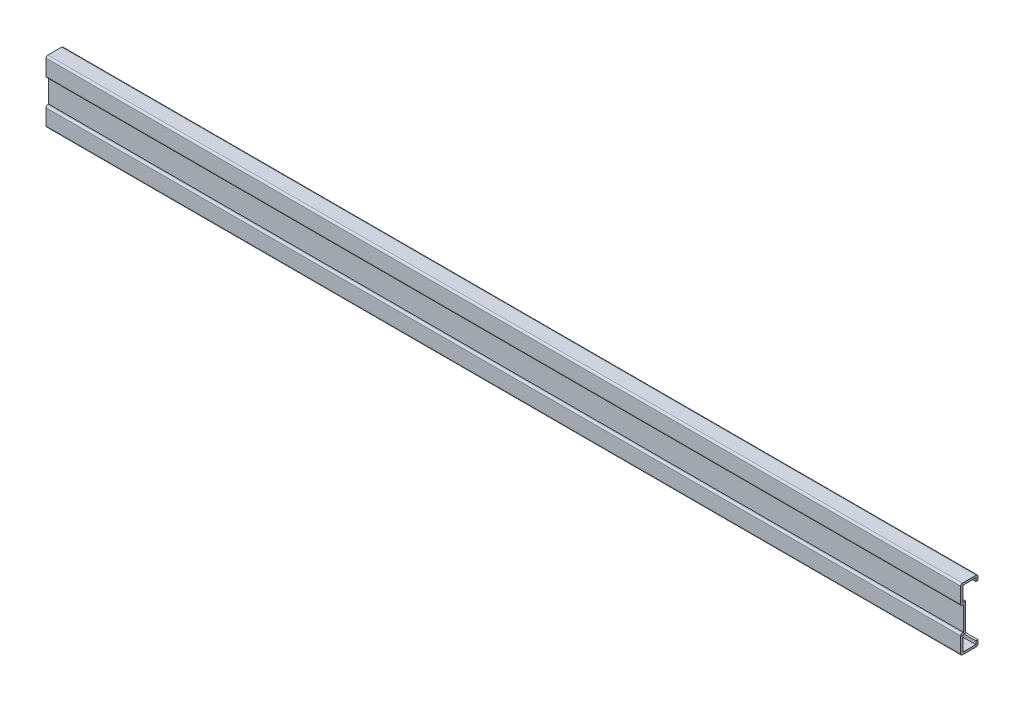
ISO-10303-21;
HEADER;
FILE_DESCRIPTION(('STEP AP214'),'2;1');
FILE_NAME('part.step','',(''),(''),'','','');
FILE_SCHEMA(('AUTOMOTIVE_DESIGN { 1 0 10303 214 1 1 1 1 }'));
ENDSEC;
DATA;
#1=APPLICATION_CONTEXT('core data for automotive mechanical design processes');
#2=APPLICATION_PROTOCOL_DEFINITION('international standard','automotive_design',2000,#1);
#3=PRODUCT_CONTEXT('',#1,'mechanical');
#4=PRODUCT('Part','Part','',(#3));
#5=PRODUCT_RELATED_PRODUCT_CATEGORY('part','',(#4));
#6=PRODUCT_DEFINITION_FORMATION('','',#4);
#7=PRODUCT_DEFINITION_CONTEXT('part definition',#1,'design');
#8=PRODUCT_DEFINITION('design','',#6,#7);
#9=PRODUCT_DEFINITION_SHAPE('','',#8);
#10=(LENGTH_UNIT() NAMED_UNIT(*) SI_UNIT(.MILLI.,.METRE.));
#11=(NAMED_UNIT(*) PLANE_ANGLE_UNIT() SI_UNIT($,.RADIAN.));
#12=(NAMED_UNIT(*) SI_UNIT($,.STERADIAN.) SOLID_ANGLE_UNIT());
#13=UNCERTAINTY_MEASURE_WITH_UNIT(LENGTH_MEASURE(1.E-05),#10,'distance_accuracy_value','');
#14=(GEOMETRIC_REPRESENTATION_CONTEXT(3) GLOBAL_UNCERTAINTY_ASSIGNED_CONTEXT((#13)) GLOBAL_UNIT_ASSIGNED_CONTEXT((#10,
#11,#12)) REPRESENTATION_CONTEXT('',''));
#15=CARTESIAN_POINT('',(0.,0.,0.));
#16=DIRECTION('',(0.,0.,1.));
#17=DIRECTION('',(1.,0.,0.));
#18=AXIS2_PLACEMENT_3D('',#15,#16,#17);
#19=CARTESIAN_POINT('',(500.,16.,-6.8));
#20=DIRECTION('',(0.,0.,-1.));
#21=DIRECTION('',(-1.,0.,0.));
#22=AXIS2_PLACEMENT_3D('',#19,#20,#21);
#23=PLANE('',#22);
#24=DIRECTION('',(0.,1.,0.));
#25=VECTOR('',#24,1.);
#26=CARTESIAN_POINT('',(0.,16.,-6.8));
#27=LINE('',#26,#25);
#28=CARTESIAN_POINT('',(0.,15.8,-6.8));
#29=VERTEX_POINT('',#28);
#30=CARTESIAN_POINT('',(0.,14.,-6.8));
#31=VERTEX_POINT('',#30);
#32=EDGE_CURVE('E237',#29,#31,#27,.F.);
#33=ORIENTED_EDGE('',*,*,#32,.T.);
#34=DIRECTION('',(-1.,0.,0.));
#35=VECTOR('',#34,1.);
#36=CARTESIAN_POINT('',(500.,14.,-6.8));
#37=LINE('',#36,#35);
#38=CARTESIAN_POINT('',(500.,14.,-6.8));
#39=VERTEX_POINT('',#38);
#40=EDGE_CURVE('E11',#39,#31,#37,.T.);
#41=ORIENTED_EDGE('',*,*,#40,.F.);
#42=DIRECTION('',(0.,1.,0.));
#43=VECTOR('',#42,1.);
#44=CARTESIAN_POINT('',(500.,16.,-6.8));
#45=LINE('',#44,#43);
#46=CARTESIAN_POINT('',(500.,15.8,-6.8));
#47=VERTEX_POINT('',#46);
#48=EDGE_CURVE('E144',#47,#39,#45,.F.);
#49=ORIENTED_EDGE('',*,*,#48,.F.);
#50=DIRECTION('',(-1.,0.,0.));
#51=VECTOR('',#50,1.);
#52=CARTESIAN_POINT('',(500.,15.8,-6.8));
#53=LINE('',#52,#51);
#54=EDGE_CURVE('E233',#47,#29,#53,.T.);
#55=ORIENTED_EDGE('',*,*,#54,.T.);
#56=EDGE_LOOP('',(#33,#41,#49,#55));
#57=FACE_BOUND('',#56,.T.);
#58=ADVANCED_FACE('F34',(#57),#23,.F.);
#59=CARTESIAN_POINT('',(500.,14.,-8.));
#60=DIRECTION('',(0.,-1.,0.));
#61=DIRECTION('',(0.,0.,-1.));
#62=AXIS2_PLACEMENT_3D('',#59,#60,#61);
#63=PLANE('',#62);
#64=DIRECTION('',(0.,0.,1.));
#65=VECTOR('',#64,1.);
#66=CARTESIAN_POINT('',(0.,14.,-8.));
#67=LINE('',#66,#65);
#68=CARTESIAN_POINT('',(0.,14.,-8.));
#69=VERTEX_POINT('',#68);
#70=EDGE_CURVE('E240',#69,#31,#67,.T.);
#71=ORIENTED_EDGE('',*,*,#70,.F.);
#72=DIRECTION('',(-1.,0.,0.));
#73=VECTOR('',#72,1.);
#74=CARTESIAN_POINT('',(500.,14.,-8.));
#75=LINE('',#74,#73);
#76=CARTESIAN_POINT('',(500.,14.,-8.));
#77=VERTEX_POINT('',#76);
#78=EDGE_CURVE('E42',#77,#69,#75,.T.);
#79=ORIENTED_EDGE('',*,*,#78,.F.);
#80=DIRECTION('',(0.,0.,1.));
#81=VECTOR('',#80,1.);
#82=CARTESIAN_POINT('',(500.,14.,-8.));
#83=LINE('',#82,#81);
#84=EDGE_CURVE('E372',#77,#39,#83,.T.);
#85=ORIENTED_EDGE('',*,*,#84,.T.);
#86=ORIENTED_EDGE('',*,*,#40,.T.);
#87=EDGE_LOOP('',(#71,#79,#85,#86));
#88=FACE_BOUND('',#87,.T.);
#89=ADVANCED_FACE('F359',(#88),#63,.T.);
#90=CARTESIAN_POINT('',(500.,16.,-8.));
#91=DIRECTION('',(0.,0.,-1.));
#92=DIRECTION('',(-1.,0.,0.));
#93=AXIS2_PLACEMENT_3D('',#90,#91,#92);
#94=PLANE('',#93);
#95=DIRECTION('',(0.,-1.,0.));
#96=VECTOR('',#95,1.);
#97=CARTESIAN_POINT('',(0.,16.,-8.));
#98=LINE('',#97,#96);
#99=CARTESIAN_POINT('',(0.,16.,-8.));
#100=VERTEX_POINT('',#99);
#101=EDGE_CURVE('E243',#100,#69,#98,.T.);
#102=ORIENTED_EDGE('',*,*,#101,.F.);
#103=DIRECTION('',(-1.,0.,0.));
#104=VECTOR('',#103,1.);
#105=CARTESIAN_POINT('',(500.,16.,-8.));
#106=LINE('',#105,#104);
#107=CARTESIAN_POINT('',(500.,16.,-8.));
#108=VERTEX_POINT('',#107);
#109=EDGE_CURVE('E349',#108,#100,#106,.T.);
#110=ORIENTED_EDGE('',*,*,#109,.F.);
#111=DIRECTION('',(0.,-1.,0.));
#112=VECTOR('',#111,1.);
#113=CARTESIAN_POINT('',(500.,16.,-8.));
#114=LINE('',#113,#112);
#115=EDGE_CURVE('E356',#108,#77,#114,.T.);
#116=ORIENTED_EDGE('',*,*,#115,.T.);
#117=ORIENTED_EDGE('',*,*,#78,.T.);
#118=EDGE_LOOP('',(#102,#110,#116,#117));
#119=FACE_BOUND('',#118,.T.);
#120=ADVANCED_FACE('F354',(#119),#94,.T.);
#121=CARTESIAN_POINT('',(500.,16.,-7.));
#122=DIRECTION('',(-1.,0.,0.));
#123=DIRECTION('',(0.,0.,1.));
#124=AXIS2_PLACEMENT_3D('',#121,#122,#123);
#125=CYLINDRICAL_SURFACE('',#124,1.);
#126=CARTESIAN_POINT('',(0.,16.,-7.));
#127=DIRECTION('',(-1.,0.,0.));
#128=DIRECTION('',(0.,0.,1.));
#129=AXIS2_PLACEMENT_3D('',#126,#127,#128);
#130=CIRCLE('',#129,1.);
#131=CARTESIAN_POINT('',(0.,17.,-7.));
#132=VERTEX_POINT('',#131);
#133=EDGE_CURVE('E246',#132,#100,#130,.T.);
#134=ORIENTED_EDGE('',*,*,#133,.F.);
#135=DIRECTION('',(-1.,0.,0.));
#136=VECTOR('',#135,1.);
#137=CARTESIAN_POINT('',(500.,17.,-7.));
#138=LINE('',#137,#136);
#139=CARTESIAN_POINT('',(500.,17.,-7.));
#140=VERTEX_POINT('',#139);
#141=EDGE_CURVE('E347',#140,#132,#138,.T.);
#142=ORIENTED_EDGE('',*,*,#141,.F.);
#143=CARTESIAN_POINT('',(500.,16.,-7.));
#144=DIRECTION('',(-1.,0.,0.));
#145=DIRECTION('',(0.,0.,1.));
#146=AXIS2_PLACEMENT_3D('',#143,#144,#145);
#147=CIRCLE('',#146,1.);
#148=EDGE_CURVE('E369',#140,#108,#147,.T.);
#149=ORIENTED_EDGE('',*,*,#148,.T.);
#150=ORIENTED_EDGE('',*,*,#109,.T.);
#151=EDGE_LOOP('',(#134,#142,#149,#150));
#152=FACE_BOUND('',#151,.T.);
#153=ADVANCED_FACE('F366',(#152),#125,.T.);
#154=CARTESIAN_POINT('',(500.,17.,0.499999999999997));
#155=DIRECTION('',(0.,1.,0.));
#156=DIRECTION('',(0.,0.,1.));
#157=AXIS2_PLACEMENT_3D('',#154,#155,#156);
#158=PLANE('',#157);
#159=DIRECTION('',(0.,0.,-1.));
#160=VECTOR('',#159,1.);
#161=CARTESIAN_POINT('',(0.,17.,0.499999999999997));
#162=LINE('',#161,#160);
#163=CARTESIAN_POINT('',(0.,17.,0.499999999999997));
#164=VERTEX_POINT('',#163);
#165=EDGE_CURVE('E249',#164,#132,#162,.T.);
#166=ORIENTED_EDGE('',*,*,#165,.F.);
#167=DIRECTION('',(-1.,0.,0.));
#168=VECTOR('',#167,1.);
#169=CARTESIAN_POINT('',(500.,17.,0.499999999999997));
#170=LINE('',#169,#168);
#171=CARTESIAN_POINT('',(500.,17.,0.499999999999997));
#172=VERTEX_POINT('',#171);
#173=EDGE_CURVE('E345',#172,#164,#170,.T.);
#174=ORIENTED_EDGE('',*,*,#173,.F.);
#175=DIRECTION('',(0.,0.,-1.));
#176=VECTOR('',#175,1.);
#177=CARTESIAN_POINT('',(500.,17.,0.499999999999997));
#178=LINE('',#177,#176);
#179=EDGE_CURVE('E374',#172,#140,#178,.T.);
#180=ORIENTED_EDGE('',*,*,#179,.T.);
#181=ORIENTED_EDGE('',*,*,#141,.T.);
#182=EDGE_LOOP('',(#166,#174,#180,#181));
#183=FACE_BOUND('',#182,.T.);
#184=ADVANCED_FACE('F458',(#183),#158,.T.);
#185=CARTESIAN_POINT('',(500.,16.,0.499999999999997));
#186=DIRECTION('',(-1.,0.,0.));
#187=DIRECTION('',(0.,0.,1.));
#188=AXIS2_PLACEMENT_3D('',#185,#186,#187);
#189=CYLINDRICAL_SURFACE('',#188,1.);
#190=CARTESIAN_POINT('',(0.,16.,0.499999999999997));
#191=DIRECTION('',(-1.,0.,0.));
#192=DIRECTION('',(0.,0.,1.));
#193=AXIS2_PLACEMENT_3D('',#190,#191,#192);
#194=CIRCLE('',#193,1.);
#195=CARTESIAN_POINT('',(0.,16.,1.5));
#196=VERTEX_POINT('',#195);
#197=EDGE_CURVE('E252',#196,#164,#194,.T.);
#198=ORIENTED_EDGE('',*,*,#197,.F.);
#199=DIRECTION('',(-1.,0.,0.));
#200=VECTOR('',#199,1.);
#201=CARTESIAN_POINT('',(500.,16.,1.5));
#202=LINE('',#201,#200);
#203=CARTESIAN_POINT('',(500.,16.,1.5));
#204=VERTEX_POINT('',#203);
#205=EDGE_CURVE('E343',#204,#196,#202,.T.);
#206=ORIENTED_EDGE('',*,*,#205,.F.);
#207=CARTESIAN_POINT('',(500.,16.,0.499999999999997));
#208=DIRECTION('',(-1.,0.,0.));
#209=DIRECTION('',(0.,0.,1.));
#210=AXIS2_PLACEMENT_3D('',#207,#208,#209);
#211=CIRCLE('',#210,1.);
#212=EDGE_CURVE('E380',#204,#172,#211,.T.);
#213=ORIENTED_EDGE('',*,*,#212,.T.);
#214=ORIENTED_EDGE('',*,*,#173,.T.);
#215=EDGE_LOOP('',(#198,#206,#213,#214));
#216=FACE_BOUND('',#215,.T.);
#217=ADVANCED_FACE('F461',(#216),#189,.T.);
#218=CARTESIAN_POINT('',(500.,7.50000000000001,1.5));
#219=DIRECTION('',(0.,0.,1.));
#220=DIRECTION('',(0.,-1.,0.));
#221=AXIS2_PLACEMENT_3D('',#218,#219,#220);
#222=PLANE('',#221);
#223=DIRECTION('',(0.,1.,0.));
#224=VECTOR('',#223,1.);
#225=CARTESIAN_POINT('',(0.,7.50000000000001,1.5));
#226=LINE('',#225,#224);
#227=CARTESIAN_POINT('',(0.,7.50000000000001,1.5));
#228=VERTEX_POINT('',#227);
#229=EDGE_CURVE('E255',#228,#196,#226,.T.);
#230=ORIENTED_EDGE('',*,*,#229,.F.);
#231=DIRECTION('',(-1.,0.,0.));
#232=VECTOR('',#231,1.);
#233=CARTESIAN_POINT('',(500.,7.50000000000001,1.5));
#234=LINE('',#233,#232);
#235=CARTESIAN_POINT('',(500.,7.50000000000001,1.5));
#236=VERTEX_POINT('',#235);
#237=EDGE_CURVE('E341',#236,#228,#234,.T.);
#238=ORIENTED_EDGE('',*,*,#237,.F.);
#239=DIRECTION('',(0.,1.,0.));
#240=VECTOR('',#239,1.);
#241=CARTESIAN_POINT('',(500.,7.50000000000001,1.5));
#242=LINE('',#241,#240);
#243=EDGE_CURVE('E383',#236,#204,#242,.T.);
#244=ORIENTED_EDGE('',*,*,#243,.T.);
#245=ORIENTED_EDGE('',*,*,#205,.T.);
#246=EDGE_LOOP('',(#230,#238,#244,#245));
#247=FACE_BOUND('',#246,.T.);
#248=ADVANCED_FACE('F465',(#247),#222,.T.);
#249=CARTESIAN_POINT('',(500.,7.5,0.499999999999999));
#250=DIRECTION('',(-1.,0.,0.));
#251=DIRECTION('',(0.,0.,1.));
#252=AXIS2_PLACEMENT_3D('',#249,#250,#251);
#253=CYLINDRICAL_SURFACE('',#252,1.);
#254=CARTESIAN_POINT('',(0.,7.5,0.499999999999999));
#255=DIRECTION('',(-1.,0.,0.));
#256=DIRECTION('',(0.,0.,-1.));
#257=AXIS2_PLACEMENT_3D('',#254,#255,#256);
#258=CIRCLE('',#257,1.);
#259=CARTESIAN_POINT('',(0.,6.5,0.499999999999994));
#260=VERTEX_POINT('',#259);
#261=EDGE_CURVE('E258',#260,#228,#258,.T.);
#262=ORIENTED_EDGE('',*,*,#261,.F.);
#263=DIRECTION('',(-1.,0.,0.));
#264=VECTOR('',#263,1.);
#265=CARTESIAN_POINT('',(500.,6.5,0.499999999999994));
#266=LINE('',#265,#264);
#267=CARTESIAN_POINT('',(500.,6.5,0.499999999999994));
#268=VERTEX_POINT('',#267);
#269=EDGE_CURVE('E339',#268,#260,#266,.T.);
#270=ORIENTED_EDGE('',*,*,#269,.F.);
#271=CARTESIAN_POINT('',(500.,7.5,0.499999999999999));
#272=DIRECTION('',(-1.,0.,0.));
#273=DIRECTION('',(0.,0.,-1.));
#274=AXIS2_PLACEMENT_3D('',#271,#272,#273);
#275=CIRCLE('',#274,1.);
#276=EDGE_CURVE('E386',#268,#236,#275,.T.);
#277=ORIENTED_EDGE('',*,*,#276,.T.);
#278=ORIENTED_EDGE('',*,*,#237,.T.);
#279=EDGE_LOOP('',(#262,#270,#277,#278));
#280=FACE_BOUND('',#279,.T.);
#281=ADVANCED_FACE('F469',(#280),#253,.T.);
#282=CARTESIAN_POINT('',(500.,6.5,0.));
#283=DIRECTION('',(0.,-1.,0.));
#284=DIRECTION('',(0.,0.,-1.));
#285=AXIS2_PLACEMENT_3D('',#282,#283,#284);
#286=PLANE('',#285);
#287=DIRECTION('',(0.,0.,1.));
#288=VECTOR('',#287,1.);
#289=CARTESIAN_POINT('',(0.,6.5,0.));
#290=LINE('',#289,#288);
#291=CARTESIAN_POINT('',(0.,6.5,0.));
#292=VERTEX_POINT('',#291);
#293=EDGE_CURVE('E261',#292,#260,#290,.T.);
#294=ORIENTED_EDGE('',*,*,#293,.F.);
#295=DIRECTION('',(-1.,0.,0.));
#296=VECTOR('',#295,1.);
#297=CARTESIAN_POINT('',(500.,6.5,0.));
#298=LINE('',#297,#296);
#299=CARTESIAN_POINT('',(500.,6.5,0.));
#300=VERTEX_POINT('',#299);
#301=EDGE_CURVE('E337',#300,#292,#298,.T.);
#302=ORIENTED_EDGE('',*,*,#301,.F.);
#303=DIRECTION('',(0.,0.,1.));
#304=VECTOR('',#303,1.);
#305=CARTESIAN_POINT('',(500.,6.5,0.));
#306=LINE('',#305,#304);
#307=EDGE_CURVE('E389',#300,#268,#306,.T.);
#308=ORIENTED_EDGE('',*,*,#307,.T.);
#309=ORIENTED_EDGE('',*,*,#269,.T.);
#310=EDGE_LOOP('',(#294,#302,#308,#309));
#311=FACE_BOUND('',#310,.T.);
#312=ADVANCED_FACE('F473',(#311),#286,.T.);
#313=CARTESIAN_POINT('',(500.,6.5,0.));
#314=DIRECTION('',(0.,0.,1.));
#315=DIRECTION('',(1.,0.,0.));
#316=AXIS2_PLACEMENT_3D('',#313,#314,#315);
#317=PLANE('',#316);
#318=DIRECTION('',(0.,1.,0.));
#319=VECTOR('',#318,1.);
#320=CARTESIAN_POINT('',(0.,6.5,0.));
#321=LINE('',#320,#319);
#322=CARTESIAN_POINT('',(0.,-6.5,0.));
#323=VERTEX_POINT('',#322);
#324=EDGE_CURVE('E264',#323,#292,#321,.T.);
#325=ORIENTED_EDGE('',*,*,#324,.F.);
#326=DIRECTION('',(-1.,0.,0.));
#327=VECTOR('',#326,1.);
#328=CARTESIAN_POINT('',(500.,-6.5,0.));
#329=LINE('',#328,#327);
#330=CARTESIAN_POINT('',(500.,-6.5,0.));
#331=VERTEX_POINT('',#330);
#332=EDGE_CURVE('E335',#331,#323,#329,.T.);
#333=ORIENTED_EDGE('',*,*,#332,.F.);
#334=DIRECTION('',(0.,1.,0.));
#335=VECTOR('',#334,1.);
#336=CARTESIAN_POINT('',(500.,6.5,0.));
#337=LINE('',#336,#335);
#338=EDGE_CURVE('E392',#331,#300,#337,.T.);
#339=ORIENTED_EDGE('',*,*,#338,.T.);
#340=ORIENTED_EDGE('',*,*,#301,.T.);
#341=EDGE_LOOP('',(#325,#333,#339,#340));
#342=FACE_BOUND('',#341,.T.);
#343=ADVANCED_FACE('F477',(#342),#317,.T.);
#344=CARTESIAN_POINT('',(500.,-6.5,0.));
#345=DIRECTION('',(0.,1.,0.));
#346=DIRECTION('',(0.,0.,1.));
#347=AXIS2_PLACEMENT_3D('',#344,#345,#346);
#348=PLANE('',#347);
#349=DIRECTION('',(0.,0.,-1.));
#350=VECTOR('',#349,1.);
#351=CARTESIAN_POINT('',(0.,-6.5,0.));
#352=LINE('',#351,#350);
#353=CARTESIAN_POINT('',(0.,-6.5,0.499999999999994));
#354=VERTEX_POINT('',#353);
#355=EDGE_CURVE('E267',#354,#323,#352,.T.);
#356=ORIENTED_EDGE('',*,*,#355,.F.);
#357=DIRECTION('',(-1.,0.,0.));
#358=VECTOR('',#357,1.);
#359=CARTESIAN_POINT('',(500.,-6.5,0.499999999999994));
#360=LINE('',#359,#358);
#361=CARTESIAN_POINT('',(500.,-6.5,0.499999999999994));
#362=VERTEX_POINT('',#361);
#363=EDGE_CURVE('E333',#362,#354,#360,.T.);
#364=ORIENTED_EDGE('',*,*,#363,.F.);
#365=DIRECTION('',(0.,0.,-1.));
#366=VECTOR('',#365,1.);
#367=CARTESIAN_POINT('',(500.,-6.5,0.));
#368=LINE('',#367,#366);
#369=EDGE_CURVE('E395',#362,#331,#368,.T.);
#370=ORIENTED_EDGE('',*,*,#369,.T.);
#371=ORIENTED_EDGE('',*,*,#332,.T.);
#372=EDGE_LOOP('',(#356,#364,#370,#371));
#373=FACE_BOUND('',#372,.T.);
#374=ADVANCED_FACE('F481',(#373),#348,.T.);
#375=CARTESIAN_POINT('',(500.,-7.5,0.499999999999999));
#376=DIRECTION('',(-1.,0.,0.));
#377=DIRECTION('',(0.,0.,1.));
#378=AXIS2_PLACEMENT_3D('',#375,#376,#377);
#379=CYLINDRICAL_SURFACE('',#378,1.);
#380=CARTESIAN_POINT('',(0.,-7.5,0.499999999999999));
#381=DIRECTION('',(-1.,0.,0.));
#382=DIRECTION('',(0.,0.,1.));
#383=AXIS2_PLACEMENT_3D('',#380,#381,#382);
#384=CIRCLE('',#383,1.);
#385=CARTESIAN_POINT('',(0.,-7.50000000000001,1.5));
#386=VERTEX_POINT('',#385);
#387=EDGE_CURVE('E270',#386,#354,#384,.T.);
#388=ORIENTED_EDGE('',*,*,#387,.F.);
#389=DIRECTION('',(-1.,0.,0.));
#390=VECTOR('',#389,1.);
#391=CARTESIAN_POINT('',(500.,-7.50000000000001,1.5));
#392=LINE('',#391,#390);
#393=CARTESIAN_POINT('',(500.,-7.50000000000001,1.5));
#394=VERTEX_POINT('',#393);
#395=EDGE_CURVE('E331',#394,#386,#392,.T.);
#396=ORIENTED_EDGE('',*,*,#395,.F.);
#397=CARTESIAN_POINT('',(500.,-7.5,0.499999999999999));
#398=DIRECTION('',(-1.,0.,0.));
#399=DIRECTION('',(0.,0.,1.));
#400=AXIS2_PLACEMENT_3D('',#397,#398,#399);
#401=CIRCLE('',#400,1.);
#402=EDGE_CURVE('E398',#394,#362,#401,.T.);
#403=ORIENTED_EDGE('',*,*,#402,.T.);
#404=ORIENTED_EDGE('',*,*,#363,.T.);
#405=EDGE_LOOP('',(#388,#396,#403,#404));
#406=FACE_BOUND('',#405,.T.);
#407=ADVANCED_FACE('F485',(#406),#379,.T.);
#408=CARTESIAN_POINT('',(500.,-7.50000000000001,1.5));
#409=DIRECTION('',(0.,0.,1.));
#410=DIRECTION('',(0.,-1.,0.));
#411=AXIS2_PLACEMENT_3D('',#408,#409,#410);
#412=PLANE('',#411);
#413=DIRECTION('',(0.,1.,0.));
#414=VECTOR('',#413,1.);
#415=CARTESIAN_POINT('',(0.,-7.50000000000001,1.5));
#416=LINE('',#415,#414);
#417=CARTESIAN_POINT('',(0.,-16.,1.5));
#418=VERTEX_POINT('',#417);
#419=EDGE_CURVE('E273',#418,#386,#416,.T.);
#420=ORIENTED_EDGE('',*,*,#419,.F.);
#421=DIRECTION('',(-1.,0.,0.));
#422=VECTOR('',#421,1.);
#423=CARTESIAN_POINT('',(500.,-16.,1.5));
#424=LINE('',#423,#422);
#425=CARTESIAN_POINT('',(500.,-16.,1.5));
#426=VERTEX_POINT('',#425);
#427=EDGE_CURVE('E329',#426,#418,#424,.T.);
#428=ORIENTED_EDGE('',*,*,#427,.F.);
#429=DIRECTION('',(0.,1.,0.));
#430=VECTOR('',#429,1.);
#431=CARTESIAN_POINT('',(500.,-7.50000000000001,1.5));
#432=LINE('',#431,#430);
#433=EDGE_CURVE('E401',#426,#394,#432,.T.);
#434=ORIENTED_EDGE('',*,*,#433,.T.);
#435=ORIENTED_EDGE('',*,*,#395,.T.);
#436=EDGE_LOOP('',(#420,#428,#434,#435));
#437=FACE_BOUND('',#436,.T.);
#438=ADVANCED_FACE('F489',(#437),#412,.T.);
#439=CARTESIAN_POINT('',(500.,-16.,0.499999999999997));
#440=DIRECTION('',(-1.,0.,0.));
#441=DIRECTION('',(0.,0.,1.));
#442=AXIS2_PLACEMENT_3D('',#439,#440,#441);
#443=CYLINDRICAL_SURFACE('',#442,1.);
#444=CARTESIAN_POINT('',(0.,-16.,0.499999999999997));
#445=DIRECTION('',(-1.,0.,0.));
#446=DIRECTION('',(0.,0.,-1.));
#447=AXIS2_PLACEMENT_3D('',#444,#445,#446);
#448=CIRCLE('',#447,1.);
#449=CARTESIAN_POINT('',(0.,-17.,0.499999999999997));
#450=VERTEX_POINT('',#449);
#451=EDGE_CURVE('E276',#450,#418,#448,.T.);
#452=ORIENTED_EDGE('',*,*,#451,.F.);
#453=DIRECTION('',(-1.,0.,0.));
#454=VECTOR('',#453,1.);
#455=CARTESIAN_POINT('',(500.,-17.,0.499999999999997));
#456=LINE('',#455,#454);
#457=CARTESIAN_POINT('',(500.,-17.,0.499999999999997));
#458=VERTEX_POINT('',#457);
#459=EDGE_CURVE('E327',#458,#450,#456,.T.);
#460=ORIENTED_EDGE('',*,*,#459,.F.);
#461=CARTESIAN_POINT('',(500.,-16.,0.499999999999997));
#462=DIRECTION('',(-1.,0.,0.));
#463=DIRECTION('',(0.,0.,-1.));
#464=AXIS2_PLACEMENT_3D('',#461,#462,#463);
#465=CIRCLE('',#464,1.);
#466=EDGE_CURVE('E404',#458,#426,#465,.T.);
#467=ORIENTED_EDGE('',*,*,#466,.T.);
#468=ORIENTED_EDGE('',*,*,#427,.T.);
#469=EDGE_LOOP('',(#452,#460,#467,#468));
#470=FACE_BOUND('',#469,.T.);
#471=ADVANCED_FACE('F493',(#470),#443,.T.);
#472=CARTESIAN_POINT('',(500.,-17.,0.499999999999997));
#473=DIRECTION('',(0.,-1.,0.));
#474=DIRECTION('',(0.,0.,-1.));
#475=AXIS2_PLACEMENT_3D('',#472,#473,#474);
#476=PLANE('',#475);
#477=DIRECTION('',(0.,0.,1.));
#478=VECTOR('',#477,1.);
#479=CARTESIAN_POINT('',(0.,-17.,0.499999999999997));
#480=LINE('',#479,#478);
#481=CARTESIAN_POINT('',(0.,-17.,-7.));
#482=VERTEX_POINT('',#481);
#483=EDGE_CURVE('E279',#482,#450,#480,.T.);
#484=ORIENTED_EDGE('',*,*,#483,.F.);
#485=DIRECTION('',(-1.,0.,0.));
#486=VECTOR('',#485,1.);
#487=CARTESIAN_POINT('',(500.,-17.,-7.));
#488=LINE('',#487,#486);
#489=CARTESIAN_POINT('',(500.,-17.,-7.));
#490=VERTEX_POINT('',#489);
#491=EDGE_CURVE('E325',#490,#482,#488,.T.);
#492=ORIENTED_EDGE('',*,*,#491,.F.);
#493=DIRECTION('',(0.,0.,1.));
#494=VECTOR('',#493,1.);
#495=CARTESIAN_POINT('',(500.,-17.,0.499999999999997));
#496=LINE('',#495,#494);
#497=EDGE_CURVE('E407',#490,#458,#496,.T.);
#498=ORIENTED_EDGE('',*,*,#497,.T.);
#499=ORIENTED_EDGE('',*,*,#459,.T.);
#500=EDGE_LOOP('',(#484,#492,#498,#499));
#501=FACE_BOUND('',#500,.T.);
#502=ADVANCED_FACE('F497',(#501),#476,.T.);
#503=CARTESIAN_POINT('',(500.,-16.,-7.));
#504=DIRECTION('',(-1.,0.,0.));
#505=DIRECTION('',(0.,0.,1.));
#506=AXIS2_PLACEMENT_3D('',#503,#504,#505);
#507=CYLINDRICAL_SURFACE('',#506,1.);
#508=CARTESIAN_POINT('',(0.,-16.,-7.));
#509=DIRECTION('',(-1.,0.,0.));
#510=DIRECTION('',(0.,0.,-1.));
#511=AXIS2_PLACEMENT_3D('',#508,#509,#510);
#512=CIRCLE('',#511,1.);
#513=CARTESIAN_POINT('',(0.,-16.,-8.));
#514=VERTEX_POINT('',#513);
#515=EDGE_CURVE('E282',#514,#482,#512,.T.);
#516=ORIENTED_EDGE('',*,*,#515,.F.);
#517=DIRECTION('',(-1.,0.,0.));
#518=VECTOR('',#517,1.);
#519=CARTESIAN_POINT('',(500.,-16.,-8.));
#520=LINE('',#519,#518);
#521=CARTESIAN_POINT('',(500.,-16.,-8.));
#522=VERTEX_POINT('',#521);
#523=EDGE_CURVE('E323',#522,#514,#520,.T.);
#524=ORIENTED_EDGE('',*,*,#523,.F.);
#525=CARTESIAN_POINT('',(500.,-16.,-7.));
#526=DIRECTION('',(-1.,0.,0.));
#527=DIRECTION('',(0.,0.,-1.));
#528=AXIS2_PLACEMENT_3D('',#525,#526,#527);
#529=CIRCLE('',#528,1.);
#530=EDGE_CURVE('E410',#522,#490,#529,.T.);
#531=ORIENTED_EDGE('',*,*,#530,.T.);
#532=ORIENTED_EDGE('',*,*,#491,.T.);
#533=EDGE_LOOP('',(#516,#524,#531,#532));
#534=FACE_BOUND('',#533,.T.);
#535=ADVANCED_FACE('F501',(#534),#507,.T.);
#536=CARTESIAN_POINT('',(500.,-16.,-8.));
#537=DIRECTION('',(0.,0.,-1.));
#538=DIRECTION('',(-1.,0.,0.));
#539=AXIS2_PLACEMENT_3D('',#536,#537,#538);
#540=PLANE('',#539);
#541=DIRECTION('',(0.,-1.,0.));
#542=VECTOR('',#541,1.);
#543=CARTESIAN_POINT('',(0.,-16.,-8.));
#544=LINE('',#543,#542);
#545=CARTESIAN_POINT('',(0.,-14.,-8.));
#546=VERTEX_POINT('',#545);
#547=EDGE_CURVE('E285',#546,#514,#544,.T.);
#548=ORIENTED_EDGE('',*,*,#547,.F.);
#549=DIRECTION('',(-1.,0.,0.));
#550=VECTOR('',#549,1.);
#551=CARTESIAN_POINT('',(500.,-14.,-8.));
#552=LINE('',#551,#550);
#553=CARTESIAN_POINT('',(500.,-14.,-8.));
#554=VERTEX_POINT('',#553);
#555=EDGE_CURVE('E321',#554,#546,#552,.T.);
#556=ORIENTED_EDGE('',*,*,#555,.F.);
#557=DIRECTION('',(0.,-1.,0.));
#558=VECTOR('',#557,1.);
#559=CARTESIAN_POINT('',(500.,-16.,-8.));
#560=LINE('',#559,#558);
#561=EDGE_CURVE('E413',#554,#522,#560,.T.);
#562=ORIENTED_EDGE('',*,*,#561,.T.);
#563=ORIENTED_EDGE('',*,*,#523,.T.);
#564=EDGE_LOOP('',(#548,#556,#562,#563));
#565=FACE_BOUND('',#564,.T.);
#566=ADVANCED_FACE('F505',(#565),#540,.T.);
#567=CARTESIAN_POINT('',(500.,-14.,-6.8));
#568=DIRECTION('',(0.,1.,0.));
#569=DIRECTION('',(0.,0.,1.));
#570=AXIS2_PLACEMENT_3D('',#567,#568,#569);
#571=PLANE('',#570);
#572=DIRECTION('',(0.,0.,-1.));
#573=VECTOR('',#572,1.);
#574=CARTESIAN_POINT('',(0.,-14.,-6.8));
#575=LINE('',#574,#573);
#576=CARTESIAN_POINT('',(0.,-14.,-6.8));
#577=VERTEX_POINT('',#576);
#578=EDGE_CURVE('E288',#577,#546,#575,.T.);
#579=ORIENTED_EDGE('',*,*,#578,.F.);
#580=DIRECTION('',(-1.,0.,0.));
#581=VECTOR('',#580,1.);
#582=CARTESIAN_POINT('',(500.,-14.,-6.8));
#583=LINE('',#582,#581);
#584=CARTESIAN_POINT('',(500.,-14.,-6.8));
#585=VERTEX_POINT('',#584);
#586=EDGE_CURVE('E319',#585,#577,#583,.T.);
#587=ORIENTED_EDGE('',*,*,#586,.F.);
#588=DIRECTION('',(0.,0.,-1.));
#589=VECTOR('',#588,1.);
#590=CARTESIAN_POINT('',(500.,-14.,-6.8));
#591=LINE('',#590,#589);
#592=EDGE_CURVE('E416',#585,#554,#591,.T.);
#593=ORIENTED_EDGE('',*,*,#592,.T.);
#594=ORIENTED_EDGE('',*,*,#555,.T.);
#595=EDGE_LOOP('',(#579,#587,#593,#594));
#596=FACE_BOUND('',#595,.T.);
#597=ADVANCED_FACE('F509',(#596),#571,.T.);
#598=CARTESIAN_POINT('',(500.,-16.,-6.8));
#599=DIRECTION('',(0.,0.,-1.));
#600=DIRECTION('',(-1.,0.,0.));
#601=AXIS2_PLACEMENT_3D('',#598,#599,#600);
#602=PLANE('',#601);
#603=DIRECTION('',(0.,1.,0.));
#604=VECTOR('',#603,1.);
#605=CARTESIAN_POINT('',(0.,-16.,-6.8));
#606=LINE('',#605,#604);
#607=CARTESIAN_POINT('',(0.,-15.8,-6.8));
#608=VERTEX_POINT('',#607);
#609=EDGE_CURVE('E291',#577,#608,#606,.F.);
#610=ORIENTED_EDGE('',*,*,#609,.T.);
#611=DIRECTION('',(-1.,0.,0.));
#612=VECTOR('',#611,1.);
#613=CARTESIAN_POINT('',(500.,-15.8,-6.8));
#614=LINE('',#613,#612);
#615=CARTESIAN_POINT('',(500.,-15.8,-6.8));
#616=VERTEX_POINT('',#615);
#617=EDGE_CURVE('E316',#616,#608,#614,.T.);
#618=ORIENTED_EDGE('',*,*,#617,.F.);
#619=DIRECTION('',(0.,1.,0.));
#620=VECTOR('',#619,1.);
#621=CARTESIAN_POINT('',(500.,-16.,-6.8));
#622=LINE('',#621,#620);
#623=EDGE_CURVE('E419',#585,#616,#622,.F.);
#624=ORIENTED_EDGE('',*,*,#623,.F.);
#625=ORIENTED_EDGE('',*,*,#586,.T.);
#626=EDGE_LOOP('',(#610,#618,#624,#625));
#627=FACE_BOUND('',#626,.T.);
#628=ADVANCED_FACE('F513',(#627),#602,.F.);
#629=CARTESIAN_POINT('',(500.,-15.8,0.499999999999997));
#630=DIRECTION('',(0.,-1.,0.));
#631=DIRECTION('',(0.,0.,-1.));
#632=AXIS2_PLACEMENT_3D('',#629,#630,#631);
#633=PLANE('',#632);
#634=DIRECTION('',(0.,0.,-1.));
#635=VECTOR('',#634,1.);
#636=CARTESIAN_POINT('',(0.,-15.8,0.499999999999997));
#637=LINE('',#636,#635);
#638=CARTESIAN_POINT('',(0.,-15.8,0.299999999999997));
#639=VERTEX_POINT('',#638);
#640=EDGE_CURVE('E293',#608,#639,#637,.F.);
#641=ORIENTED_EDGE('',*,*,#640,.T.);
#642=DIRECTION('',(-1.,0.,0.));
#643=VECTOR('',#642,1.);
#644=CARTESIAN_POINT('',(500.,-15.8,0.299999999999997));
#645=LINE('',#644,#643);
#646=CARTESIAN_POINT('',(500.,-15.8,0.299999999999997));
#647=VERTEX_POINT('',#646);
#648=EDGE_CURVE('E313',#647,#639,#645,.T.);
#649=ORIENTED_EDGE('',*,*,#648,.F.);
#650=DIRECTION('',(0.,0.,-1.));
#651=VECTOR('',#650,1.);
#652=CARTESIAN_POINT('',(500.,-15.8,0.499999999999997));
#653=LINE('',#652,#651);
#654=EDGE_CURVE('E421',#616,#647,#653,.F.);
#655=ORIENTED_EDGE('',*,*,#654,.F.);
#656=ORIENTED_EDGE('',*,*,#617,.T.);
#657=EDGE_LOOP('',(#641,#649,#655,#656));
#658=FACE_BOUND('',#657,.T.);
#659=ADVANCED_FACE('F517',(#658),#633,.F.);
#660=CARTESIAN_POINT('',(500.,-7.50000000000001,0.299999999999998));
#661=DIRECTION('',(0.,0.,1.));
#662=DIRECTION('',(0.,-1.,0.));
#663=AXIS2_PLACEMENT_3D('',#660,#661,#662);
#664=PLANE('',#663);
#665=DIRECTION('',(0.,1.,0.));
#666=VECTOR('',#665,1.);
#667=CARTESIAN_POINT('',(0.,-7.50000000000001,0.299999999999998));
#668=LINE('',#667,#666);
#669=CARTESIAN_POINT('',(0.,-7.7,0.299999999999998));
#670=VERTEX_POINT('',#669);
#671=EDGE_CURVE('E295',#639,#670,#668,.T.);
#672=ORIENTED_EDGE('',*,*,#671,.T.);
#673=DIRECTION('',(-1.,0.,0.));
#674=VECTOR('',#673,1.);
#675=CARTESIAN_POINT('',(500.,-7.7,0.299999999999998));
#676=LINE('',#675,#674);
#677=CARTESIAN_POINT('',(500.,-7.7,0.299999999999998));
#678=VERTEX_POINT('',#677);
#679=EDGE_CURVE('E310',#678,#670,#676,.T.);
#680=ORIENTED_EDGE('',*,*,#679,.F.);
#681=DIRECTION('',(0.,1.,0.));
#682=VECTOR('',#681,1.);
#683=CARTESIAN_POINT('',(500.,-7.50000000000001,0.299999999999998));
#684=LINE('',#683,#682);
#685=EDGE_CURVE('E423',#647,#678,#684,.T.);
#686=ORIENTED_EDGE('',*,*,#685,.F.);
#687=ORIENTED_EDGE('',*,*,#648,.T.);
#688=EDGE_LOOP('',(#672,#680,#686,#687));
#689=FACE_BOUND('',#688,.T.);
#690=ADVANCED_FACE('F521',(#689),#664,.F.);
#691=CARTESIAN_POINT('',(500.,-7.7,0.));
#692=DIRECTION('',(0.,1.,0.));
#693=DIRECTION('',(0.,0.,1.));
#694=AXIS2_PLACEMENT_3D('',#691,#692,#693);
#695=PLANE('',#694);
#696=DIRECTION('',(0.,0.,-1.));
#697=VECTOR('',#696,1.);
#698=CARTESIAN_POINT('',(0.,-7.7,0.));
#699=LINE('',#698,#697);
#700=CARTESIAN_POINT('',(0.,-7.69999999999999,-1.2));
#701=VERTEX_POINT('',#700);
#702=EDGE_CURVE('E297',#670,#701,#699,.T.);
#703=ORIENTED_EDGE('',*,*,#702,.T.);
#704=DIRECTION('',(-1.,0.,0.));
#705=VECTOR('',#704,1.);
#706=CARTESIAN_POINT('',(500.,-7.69999999999999,-1.2));
#707=LINE('',#706,#705);
#708=CARTESIAN_POINT('',(500.,-7.69999999999999,-1.2));
#709=VERTEX_POINT('',#708);
#710=EDGE_CURVE('E307',#709,#701,#707,.T.);
#711=ORIENTED_EDGE('',*,*,#710,.F.);
#712=DIRECTION('',(0.,0.,-1.));
#713=VECTOR('',#712,1.);
#714=CARTESIAN_POINT('',(500.,-7.7,0.));
#715=LINE('',#714,#713);
#716=EDGE_CURVE('E425',#678,#709,#715,.T.);
#717=ORIENTED_EDGE('',*,*,#716,.F.);
#718=ORIENTED_EDGE('',*,*,#679,.T.);
#719=EDGE_LOOP('',(#703,#711,#717,#718));
#720=FACE_BOUND('',#719,.T.);
#721=ADVANCED_FACE('F431',(#720),#695,.F.);
#722=CARTESIAN_POINT('',(500.,6.5,-1.2));
#723=DIRECTION('',(0.,0.,1.));
#724=DIRECTION('',(1.,0.,0.));
#725=AXIS2_PLACEMENT_3D('',#722,#723,#724);
#726=PLANE('',#725);
#727=DIRECTION('',(0.,1.,0.));
#728=VECTOR('',#727,1.);
#729=CARTESIAN_POINT('',(0.,6.5,-1.2));
#730=LINE('',#729,#728);
#731=CARTESIAN_POINT('',(0.,7.69999999999999,-1.2));
#732=VERTEX_POINT('',#731);
#733=EDGE_CURVE('E299',#701,#732,#730,.T.);
#734=ORIENTED_EDGE('',*,*,#733,.T.);
#735=DIRECTION('',(-1.,0.,0.));
#736=VECTOR('',#735,1.);
#737=CARTESIAN_POINT('',(500.,7.69999999999999,-1.2));
#738=LINE('',#737,#736);
#739=CARTESIAN_POINT('',(500.,7.69999999999999,-1.2));
#740=VERTEX_POINT('',#739);
#741=EDGE_CURVE('E228',#740,#732,#738,.T.);
#742=ORIENTED_EDGE('',*,*,#741,.F.);
#743=DIRECTION('',(0.,1.,0.));
#744=VECTOR('',#743,1.);
#745=CARTESIAN_POINT('',(500.,6.5,-1.2));
#746=LINE('',#745,#744);
#747=EDGE_CURVE('E219',#709,#740,#746,.T.);
#748=ORIENTED_EDGE('',*,*,#747,.F.);
#749=ORIENTED_EDGE('',*,*,#710,.T.);
#750=EDGE_LOOP('',(#734,#742,#748,#749));
#751=FACE_BOUND('',#750,.T.);
#752=ADVANCED_FACE('F435',(#751),#726,.F.);
#753=CARTESIAN_POINT('',(500.,7.7,0.));
#754=DIRECTION('',(0.,-1.,0.));
#755=DIRECTION('',(0.,0.,-1.));
#756=AXIS2_PLACEMENT_3D('',#753,#754,#755);
#757=PLANE('',#756);
#758=DIRECTION('',(0.,0.,1.));
#759=VECTOR('',#758,1.);
#760=CARTESIAN_POINT('',(0.,7.7,0.));
#761=LINE('',#760,#759);
#762=CARTESIAN_POINT('',(0.,7.7,0.299999999999998));
#763=VERTEX_POINT('',#762);
#764=EDGE_CURVE('E227',#732,#763,#761,.T.);
#765=ORIENTED_EDGE('',*,*,#764,.T.);
#766=DIRECTION('',(-1.,0.,0.));
#767=VECTOR('',#766,1.);
#768=CARTESIAN_POINT('',(500.,7.7,0.299999999999998));
#769=LINE('',#768,#767);
#770=CARTESIAN_POINT('',(500.,7.7,0.299999999999998));
#771=VERTEX_POINT('',#770);
#772=EDGE_CURVE('E224',#771,#763,#769,.T.);
#773=ORIENTED_EDGE('',*,*,#772,.F.);
#774=DIRECTION('',(0.,0.,1.));
#775=VECTOR('',#774,1.);
#776=CARTESIAN_POINT('',(500.,7.7,0.));
#777=LINE('',#776,#775);
#778=EDGE_CURVE('E213',#740,#771,#777,.T.);
#779=ORIENTED_EDGE('',*,*,#778,.F.);
#780=ORIENTED_EDGE('',*,*,#741,.T.);
#781=EDGE_LOOP('',(#765,#773,#779,#780));
#782=FACE_BOUND('',#781,.T.);
#783=ADVANCED_FACE('F225',(#782),#757,.F.);
#784=CARTESIAN_POINT('',(500.,7.50000000000001,0.299999999999998));
#785=DIRECTION('',(0.,0.,1.));
#786=DIRECTION('',(0.,-1.,0.));
#787=AXIS2_PLACEMENT_3D('',#784,#785,#786);
#788=PLANE('',#787);
#789=DIRECTION('',(0.,1.,0.));
#790=VECTOR('',#789,1.);
#791=CARTESIAN_POINT('',(0.,7.50000000000001,0.299999999999998));
#792=LINE('',#791,#790);
#793=CARTESIAN_POINT('',(0.,15.8,0.299999999999997));
#794=VERTEX_POINT('',#793);
#795=EDGE_CURVE('E132',#763,#794,#792,.T.);
#796=ORIENTED_EDGE('',*,*,#795,.T.);
#797=DIRECTION('',(-1.,0.,0.));
#798=VECTOR('',#797,1.);
#799=CARTESIAN_POINT('',(500.,15.8,0.299999999999997));
#800=LINE('',#799,#798);
#801=CARTESIAN_POINT('',(500.,15.8,0.299999999999997));
#802=VERTEX_POINT('',#801);
#803=EDGE_CURVE('E229',#802,#794,#800,.T.);
#804=ORIENTED_EDGE('',*,*,#803,.F.);
#805=DIRECTION('',(0.,1.,0.));
#806=VECTOR('',#805,1.);
#807=CARTESIAN_POINT('',(500.,7.50000000000001,0.299999999999998));
#808=LINE('',#807,#806);
#809=EDGE_CURVE('E217',#771,#802,#808,.T.);
#810=ORIENTED_EDGE('',*,*,#809,.F.);
#811=ORIENTED_EDGE('',*,*,#772,.T.);
#812=EDGE_LOOP('',(#796,#804,#810,#811));
#813=FACE_BOUND('',#812,.T.);
#814=ADVANCED_FACE('F231',(#813),#788,.F.);
#815=CARTESIAN_POINT('',(500.,15.8,0.499999999999997));
#816=DIRECTION('',(0.,1.,0.));
#817=DIRECTION('',(0.,0.,1.));
#818=AXIS2_PLACEMENT_3D('',#815,#816,#817);
#819=PLANE('',#818);
#820=DIRECTION('',(0.,0.,-1.));
#821=VECTOR('',#820,1.);
#822=CARTESIAN_POINT('',(0.,15.8,0.499999999999997));
#823=LINE('',#822,#821);
#824=EDGE_CURVE('E138',#794,#29,#823,.T.);
#825=ORIENTED_EDGE('',*,*,#824,.T.);
#826=ORIENTED_EDGE('',*,*,#54,.F.);
#827=DIRECTION('',(0.,0.,-1.));
#828=VECTOR('',#827,1.);
#829=CARTESIAN_POINT('',(500.,15.8,0.499999999999997));
#830=LINE('',#829,#828);
#831=EDGE_CURVE('E50',#802,#47,#830,.T.);
#832=ORIENTED_EDGE('',*,*,#831,.F.);
#833=ORIENTED_EDGE('',*,*,#803,.T.);
#834=EDGE_LOOP('',(#825,#826,#832,#833));
#835=FACE_BOUND('',#834,.T.);
#836=ADVANCED_FACE('F437',(#835),#819,.F.);
#837=CARTESIAN_POINT('',(500.,16.,-7.));
#838=DIRECTION('',(-1.,0.,0.));
#839=DIRECTION('',(0.,0.,1.));
#840=AXIS2_PLACEMENT_3D('',#837,#838,#839);
#841=PLANE('',#840);
#842=ORIENTED_EDGE('',*,*,#48,.T.);
#843=ORIENTED_EDGE('',*,*,#84,.F.);
#844=ORIENTED_EDGE('',*,*,#115,.F.);
#845=ORIENTED_EDGE('',*,*,#148,.F.);
#846=ORIENTED_EDGE('',*,*,#179,.F.);
#847=ORIENTED_EDGE('',*,*,#212,.F.);
#848=ORIENTED_EDGE('',*,*,#243,.F.);
#849=ORIENTED_EDGE('',*,*,#276,.F.);
#850=ORIENTED_EDGE('',*,*,#307,.F.);
#851=ORIENTED_EDGE('',*,*,#338,.F.);
#852=ORIENTED_EDGE('',*,*,#369,.F.);
#853=ORIENTED_EDGE('',*,*,#402,.F.);
#854=ORIENTED_EDGE('',*,*,#433,.F.);
#855=ORIENTED_EDGE('',*,*,#466,.F.);
#856=ORIENTED_EDGE('',*,*,#497,.F.);
#857=ORIENTED_EDGE('',*,*,#530,.F.);
#858=ORIENTED_EDGE('',*,*,#561,.F.);
#859=ORIENTED_EDGE('',*,*,#592,.F.);
#860=ORIENTED_EDGE('',*,*,#623,.T.);
#861=ORIENTED_EDGE('',*,*,#654,.T.);
#862=ORIENTED_EDGE('',*,*,#685,.T.);
#863=ORIENTED_EDGE('',*,*,#716,.T.);
#864=ORIENTED_EDGE('',*,*,#747,.T.);
#865=ORIENTED_EDGE('',*,*,#778,.T.);
#866=ORIENTED_EDGE('',*,*,#809,.T.);
#867=ORIENTED_EDGE('',*,*,#831,.T.);
#868=EDGE_LOOP('',(#842,#843,#844,#845,#846,#847,#848,#849,#850,#851,#852,#853,#854,#855,#856,
#857,#858,#859,#860,#861,#862,#863,#864,#865,#866,#867));
#869=FACE_BOUND('',#868,.T.);
#870=ADVANCED_FACE('F215',(#869),#841,.F.);
#871=CARTESIAN_POINT('',(0.,16.,-7.));
#872=DIRECTION('',(-1.,0.,0.));
#873=DIRECTION('',(0.,0.,1.));
#874=AXIS2_PLACEMENT_3D('',#871,#872,#873);
#875=PLANE('',#874);
#876=ORIENTED_EDGE('',*,*,#32,.F.);
#877=ORIENTED_EDGE('',*,*,#824,.F.);
#878=ORIENTED_EDGE('',*,*,#795,.F.);
#879=ORIENTED_EDGE('',*,*,#764,.F.);
#880=ORIENTED_EDGE('',*,*,#733,.F.);
#881=ORIENTED_EDGE('',*,*,#702,.F.);
#882=ORIENTED_EDGE('',*,*,#671,.F.);
#883=ORIENTED_EDGE('',*,*,#640,.F.);
#884=ORIENTED_EDGE('',*,*,#609,.F.);
#885=ORIENTED_EDGE('',*,*,#578,.T.);
#886=ORIENTED_EDGE('',*,*,#547,.T.);
#887=ORIENTED_EDGE('',*,*,#515,.T.);
#888=ORIENTED_EDGE('',*,*,#483,.T.);
#889=ORIENTED_EDGE('',*,*,#451,.T.);
#890=ORIENTED_EDGE('',*,*,#419,.T.);
#891=ORIENTED_EDGE('',*,*,#387,.T.);
#892=ORIENTED_EDGE('',*,*,#355,.T.);
#893=ORIENTED_EDGE('',*,*,#324,.T.);
#894=ORIENTED_EDGE('',*,*,#293,.T.);
#895=ORIENTED_EDGE('',*,*,#261,.T.);
#896=ORIENTED_EDGE('',*,*,#229,.T.);
#897=ORIENTED_EDGE('',*,*,#197,.T.);
#898=ORIENTED_EDGE('',*,*,#165,.T.);
#899=ORIENTED_EDGE('',*,*,#133,.T.);
#900=ORIENTED_EDGE('',*,*,#101,.T.);
#901=ORIENTED_EDGE('',*,*,#70,.T.);
#902=EDGE_LOOP('',(#876,#877,#878,#879,#880,#881,#882,#883,#884,#885,#886,#887,#888,#889,#890,
#891,#892,#893,#894,#895,#896,#897,#898,#899,#900,#901));
#903=FACE_BOUND('',#902,.T.);
#904=ADVANCED_FACE('F362',(#903),#875,.T.);
#905=CLOSED_SHELL('',(#58,#89,#120,#153,#184,#217,#248,#281,#312,#343,#374,#407,#438,#471,#502,
#535,#566,#597,#628,#659,#690,#721,#752,#783,#814,#836,#870,#904));
#906=MANIFOLD_SOLID_BREP('B2',#905);
#907=ADVANCED_BREP_SHAPE_REPRESENTATION('',(#18,#906),#14);
#908=SHAPE_DEFINITION_REPRESENTATION(#9,#907);
ENDSEC;
END-ISO-10303-21;
